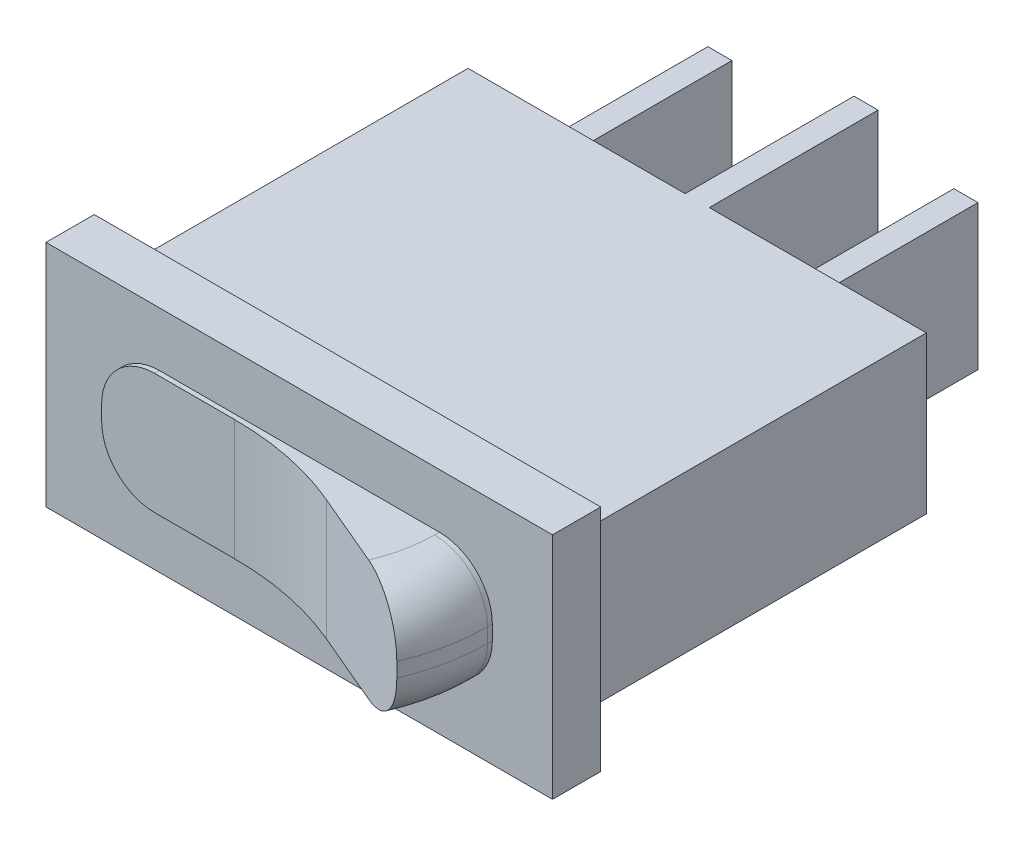
ISO-10303-21;
HEADER;
FILE_DESCRIPTION(('STEP AP214'),'2;1');
FILE_NAME('part.step','',(''),(''),'','','');
FILE_SCHEMA(('AUTOMOTIVE_DESIGN { 1 0 10303 214 1 1 1 1 }'));
ENDSEC;
DATA;
#1=APPLICATION_CONTEXT('core data for automotive mechanical design processes');
#2=APPLICATION_PROTOCOL_DEFINITION('international standard','automotive_design',2000,#1);
#3=PRODUCT_CONTEXT('',#1,'mechanical');
#4=PRODUCT('Part','Part','',(#3));
#5=PRODUCT_RELATED_PRODUCT_CATEGORY('part','',(#4));
#6=PRODUCT_DEFINITION_FORMATION('','',#4);
#7=PRODUCT_DEFINITION_CONTEXT('part definition',#1,'design');
#8=PRODUCT_DEFINITION('design','',#6,#7);
#9=PRODUCT_DEFINITION_SHAPE('','',#8);
#10=(LENGTH_UNIT() NAMED_UNIT(*) SI_UNIT(.MILLI.,.METRE.));
#11=(NAMED_UNIT(*) PLANE_ANGLE_UNIT() SI_UNIT($,.RADIAN.));
#12=(NAMED_UNIT(*) SI_UNIT($,.STERADIAN.) SOLID_ANGLE_UNIT());
#13=UNCERTAINTY_MEASURE_WITH_UNIT(LENGTH_MEASURE(1.E-05),#10,'distance_accuracy_value','');
#14=(GEOMETRIC_REPRESENTATION_CONTEXT(3) GLOBAL_UNCERTAINTY_ASSIGNED_CONTEXT((#13)) GLOBAL_UNIT_ASSIGNED_CONTEXT((#10,
#11,#12)) REPRESENTATION_CONTEXT('',''));
#15=CARTESIAN_POINT('',(0.,0.,0.));
#16=DIRECTION('',(0.,0.,1.));
#17=DIRECTION('',(1.,0.,0.));
#18=AXIS2_PLACEMENT_3D('',#15,#16,#17);
#19=CARTESIAN_POINT('',(0.,0.,-14.5));
#20=DIRECTION('',(0.,0.,-1.));
#21=DIRECTION('',(-1.,0.,0.));
#22=AXIS2_PLACEMENT_3D('',#19,#20,#21);
#23=PLANE('',#22);
#24=DIRECTION('',(0.,1.,0.));
#25=VECTOR('',#24,1.);
#26=CARTESIAN_POINT('',(10.,1.5,-14.5));
#27=LINE('',#26,#25);
#28=CARTESIAN_POINT('',(10.,1.5,-14.5));
#29=VERTEX_POINT('',#28);
#30=CARTESIAN_POINT('',(10.,8.,-14.5));
#31=VERTEX_POINT('',#30);
#32=EDGE_CURVE('E478',#29,#31,#27,.T.);
#33=ORIENTED_EDGE('',*,*,#32,.F.);
#34=DIRECTION('',(-1.,0.,0.));
#35=VECTOR('',#34,1.);
#36=CARTESIAN_POINT('',(10.,1.5,-14.5));
#37=LINE('',#36,#35);
#38=CARTESIAN_POINT('',(1.,1.5,-14.5));
#39=VERTEX_POINT('',#38);
#40=EDGE_CURVE('E480',#29,#39,#37,.T.);
#41=ORIENTED_EDGE('',*,*,#40,.T.);
#42=DIRECTION('',(0.,1.,0.));
#43=VECTOR('',#42,1.);
#44=CARTESIAN_POINT('',(1.,1.5,-14.5));
#45=LINE('',#44,#43);
#46=CARTESIAN_POINT('',(1.,8.,-14.5));
#47=VERTEX_POINT('',#46);
#48=EDGE_CURVE('E462',#39,#47,#45,.T.);
#49=ORIENTED_EDGE('',*,*,#48,.T.);
#50=DIRECTION('',(1.,0.,0.));
#51=VECTOR('',#50,1.);
#52=CARTESIAN_POINT('',(1.,8.,-14.5));
#53=LINE('',#52,#51);
#54=EDGE_CURVE('E444',#47,#31,#53,.T.);
#55=ORIENTED_EDGE('',*,*,#54,.T.);
#56=EDGE_LOOP('',(#33,#41,#49,#55));
#57=FACE_BOUND('',#56,.T.);
#58=DIRECTION('',(-1.,0.,0.));
#59=VECTOR('',#58,1.);
#60=CARTESIAN_POINT('',(4.941151629397,1.75,-14.5));
#61=LINE('',#60,#59);
#62=CARTESIAN_POINT('',(5.941151629397,1.75,-14.5));
#63=VERTEX_POINT('',#62);
#64=CARTESIAN_POINT('',(4.941151629397,1.75,-14.5));
#65=VERTEX_POINT('',#64);
#66=EDGE_CURVE('E1025',#63,#65,#61,.T.);
#67=ORIENTED_EDGE('',*,*,#66,.F.);
#68=DIRECTION('',(0.,-1.,0.));
#69=VECTOR('',#68,1.);
#70=CARTESIAN_POINT('',(5.941151629397,1.75,-14.5));
#71=LINE('',#70,#69);
#72=CARTESIAN_POINT('',(5.941151629397,7.75,-14.5));
#73=VERTEX_POINT('',#72);
#74=EDGE_CURVE('E269',#73,#63,#71,.T.);
#75=ORIENTED_EDGE('',*,*,#74,.F.);
#76=DIRECTION('',(1.,0.,0.));
#77=VECTOR('',#76,1.);
#78=CARTESIAN_POINT('',(4.941151629397,7.75,-14.5));
#79=LINE('',#78,#77);
#80=CARTESIAN_POINT('',(4.941151629397,7.75,-14.5));
#81=VERTEX_POINT('',#80);
#82=EDGE_CURVE('E265',#81,#73,#79,.T.);
#83=ORIENTED_EDGE('',*,*,#82,.F.);
#84=DIRECTION('',(0.,1.,0.));
#85=VECTOR('',#84,1.);
#86=CARTESIAN_POINT('',(4.941151629397,1.75,-14.5));
#87=LINE('',#86,#85);
#88=EDGE_CURVE('E1022',#65,#81,#87,.T.);
#89=ORIENTED_EDGE('',*,*,#88,.F.);
#90=EDGE_LOOP('',(#67,#75,#83,#89));
#91=FACE_BOUND('',#90,.T.);
#92=ADVANCED_FACE('F36',(#57,#91),#23,.T.);
#93=CARTESIAN_POINT('',(0.,0.,-14.5));
#94=DIRECTION('',(0.,0.,-1.));
#95=DIRECTION('',(-1.,0.,0.));
#96=AXIS2_PLACEMENT_3D('',#93,#94,#95);
#97=PLANE('',#96);
#98=DIRECTION('',(0.,-1.,0.));
#99=VECTOR('',#98,1.);
#100=CARTESIAN_POINT('',(11.,8.,-14.5));
#101=LINE('',#100,#99);
#102=CARTESIAN_POINT('',(11.,8.,-14.5));
#103=VERTEX_POINT('',#102);
#104=CARTESIAN_POINT('',(11.,1.5,-14.5));
#105=VERTEX_POINT('',#104);
#106=EDGE_CURVE('E485',#103,#105,#101,.T.);
#107=ORIENTED_EDGE('',*,*,#106,.F.);
#108=DIRECTION('',(1.,0.,0.));
#109=VECTOR('',#108,1.);
#110=CARTESIAN_POINT('',(11.,8.,-14.5));
#111=LINE('',#110,#109);
#112=CARTESIAN_POINT('',(20.,8.,-14.5));
#113=VERTEX_POINT('',#112);
#114=EDGE_CURVE('E475',#103,#113,#111,.T.);
#115=ORIENTED_EDGE('',*,*,#114,.T.);
#116=DIRECTION('',(0.,-1.,0.));
#117=VECTOR('',#116,1.);
#118=CARTESIAN_POINT('',(20.,8.,-14.5));
#119=LINE('',#118,#117);
#120=CARTESIAN_POINT('',(20.,1.5,-14.5));
#121=VERTEX_POINT('',#120);
#122=EDGE_CURVE('E471',#113,#121,#119,.T.);
#123=ORIENTED_EDGE('',*,*,#122,.T.);
#124=DIRECTION('',(-1.,0.,0.));
#125=VECTOR('',#124,1.);
#126=CARTESIAN_POINT('',(20.,1.5,-14.5));
#127=LINE('',#126,#125);
#128=EDGE_CURVE('E459',#121,#105,#127,.T.);
#129=ORIENTED_EDGE('',*,*,#128,.T.);
#130=EDGE_LOOP('',(#107,#115,#123,#129));
#131=FACE_BOUND('',#130,.T.);
#132=DIRECTION('',(-1.,0.,0.));
#133=VECTOR('',#132,1.);
#134=CARTESIAN_POINT('',(15.1420231591906,1.75,-14.5));
#135=LINE('',#134,#133);
#136=CARTESIAN_POINT('',(16.1420231591906,1.75,-14.5));
#137=VERTEX_POINT('',#136);
#138=CARTESIAN_POINT('',(15.1420231591906,1.75,-14.5));
#139=VERTEX_POINT('',#138);
#140=EDGE_CURVE('E274',#137,#139,#135,.T.);
#141=ORIENTED_EDGE('',*,*,#140,.F.);
#142=DIRECTION('',(0.,-1.,0.));
#143=VECTOR('',#142,1.);
#144=CARTESIAN_POINT('',(16.1420231591906,1.75,-14.5));
#145=LINE('',#144,#143);
#146=CARTESIAN_POINT('',(16.1420231591906,7.75,-14.5));
#147=VERTEX_POINT('',#146);
#148=EDGE_CURVE('E271',#147,#137,#145,.T.);
#149=ORIENTED_EDGE('',*,*,#148,.F.);
#150=DIRECTION('',(1.,0.,0.));
#151=VECTOR('',#150,1.);
#152=CARTESIAN_POINT('',(15.1420231591906,7.75,-14.5));
#153=LINE('',#152,#151);
#154=CARTESIAN_POINT('',(15.1420231591906,7.75,-14.5));
#155=VERTEX_POINT('',#154);
#156=EDGE_CURVE('E283',#155,#147,#153,.T.);
#157=ORIENTED_EDGE('',*,*,#156,.F.);
#158=DIRECTION('',(0.,1.,0.));
#159=VECTOR('',#158,1.);
#160=CARTESIAN_POINT('',(15.1420231591906,1.75,-14.5));
#161=LINE('',#160,#159);
#162=EDGE_CURVE('E291',#139,#155,#161,.T.);
#163=ORIENTED_EDGE('',*,*,#162,.F.);
#164=EDGE_LOOP('',(#141,#149,#157,#163));
#165=FACE_BOUND('',#164,.T.);
#166=ADVANCED_FACE('F522',(#131,#165),#97,.T.);
#167=CARTESIAN_POINT('',(20.,1.5,0.));
#168=DIRECTION('',(0.,-1.,0.));
#169=DIRECTION('',(-1.,0.,0.));
#170=AXIS2_PLACEMENT_3D('',#167,#168,#169);
#171=PLANE('',#170);
#172=DIRECTION('',(1.,0.,0.));
#173=VECTOR('',#172,1.);
#174=CARTESIAN_POINT('',(1.,1.5,0.));
#175=LINE('',#174,#173);
#176=CARTESIAN_POINT('',(1.,1.5,0.));
#177=VERTEX_POINT('',#176);
#178=CARTESIAN_POINT('',(20.,1.5,0.));
#179=VERTEX_POINT('',#178);
#180=EDGE_CURVE('E11',#177,#179,#175,.T.);
#181=ORIENTED_EDGE('',*,*,#180,.F.);
#182=DIRECTION('',(0.,0.,-1.));
#183=VECTOR('',#182,1.);
#184=CARTESIAN_POINT('',(1.,1.5,0.));
#185=LINE('',#184,#183);
#186=EDGE_CURVE('E487',#177,#39,#185,.T.);
#187=ORIENTED_EDGE('',*,*,#186,.T.);
#188=ORIENTED_EDGE('',*,*,#40,.F.);
#189=DIRECTION('',(0.,0.,-1.));
#190=VECTOR('',#189,1.);
#191=CARTESIAN_POINT('',(10.,1.5,-14.5));
#192=LINE('',#191,#190);
#193=CARTESIAN_POINT('',(10.,1.5,-21.5));
#194=VERTEX_POINT('',#193);
#195=EDGE_CURVE('E473',#29,#194,#192,.T.);
#196=ORIENTED_EDGE('',*,*,#195,.T.);
#197=DIRECTION('',(-1.,0.,0.));
#198=VECTOR('',#197,1.);
#199=CARTESIAN_POINT('',(11.,1.5,-21.5));
#200=LINE('',#199,#198);
#201=CARTESIAN_POINT('',(11.,1.5,-21.5));
#202=VERTEX_POINT('',#201);
#203=EDGE_CURVE('E466',#202,#194,#200,.T.);
#204=ORIENTED_EDGE('',*,*,#203,.F.);
#205=DIRECTION('',(0.,0.,-1.));
#206=VECTOR('',#205,1.);
#207=CARTESIAN_POINT('',(11.,1.5,-14.5));
#208=LINE('',#207,#206);
#209=EDGE_CURVE('E453',#105,#202,#208,.T.);
#210=ORIENTED_EDGE('',*,*,#209,.F.);
#211=ORIENTED_EDGE('',*,*,#128,.F.);
#212=DIRECTION('',(0.,0.,-1.));
#213=VECTOR('',#212,1.);
#214=CARTESIAN_POINT('',(20.,1.5,0.));
#215=LINE('',#214,#213);
#216=EDGE_CURVE('E432',#179,#121,#215,.T.);
#217=ORIENTED_EDGE('',*,*,#216,.F.);
#218=EDGE_LOOP('',(#181,#187,#188,#196,#204,#210,#211,#217));
#219=FACE_BOUND('',#218,.T.);
#220=ADVANCED_FACE('F38',(#219),#171,.T.);
#221=CARTESIAN_POINT('',(1.,8.,0.));
#222=DIRECTION('',(0.,1.,0.));
#223=DIRECTION('',(1.,0.,0.));
#224=AXIS2_PLACEMENT_3D('',#221,#222,#223);
#225=PLANE('',#224);
#226=DIRECTION('',(-1.,0.,0.));
#227=VECTOR('',#226,1.);
#228=CARTESIAN_POINT('',(20.,8.,0.));
#229=LINE('',#228,#227);
#230=CARTESIAN_POINT('',(20.,8.,0.));
#231=VERTEX_POINT('',#230);
#232=CARTESIAN_POINT('',(1.,8.,0.));
#233=VERTEX_POINT('',#232);
#234=EDGE_CURVE('E44',#231,#233,#229,.T.);
#235=ORIENTED_EDGE('',*,*,#234,.F.);
#236=DIRECTION('',(0.,0.,-1.));
#237=VECTOR('',#236,1.);
#238=CARTESIAN_POINT('',(20.,8.,0.));
#239=LINE('',#238,#237);
#240=EDGE_CURVE('E483',#231,#113,#239,.T.);
#241=ORIENTED_EDGE('',*,*,#240,.T.);
#242=ORIENTED_EDGE('',*,*,#114,.F.);
#243=DIRECTION('',(0.,0.,-1.));
#244=VECTOR('',#243,1.);
#245=CARTESIAN_POINT('',(11.,8.,-14.5));
#246=LINE('',#245,#244);
#247=CARTESIAN_POINT('',(11.,8.,-21.5));
#248=VERTEX_POINT('',#247);
#249=EDGE_CURVE('E469',#103,#248,#246,.T.);
#250=ORIENTED_EDGE('',*,*,#249,.T.);
#251=DIRECTION('',(1.,0.,0.));
#252=VECTOR('',#251,1.);
#253=CARTESIAN_POINT('',(10.,8.,-21.5));
#254=LINE('',#253,#252);
#255=CARTESIAN_POINT('',(10.,8.,-21.5));
#256=VERTEX_POINT('',#255);
#257=EDGE_CURVE('E456',#256,#248,#254,.T.);
#258=ORIENTED_EDGE('',*,*,#257,.F.);
#259=DIRECTION('',(0.,0.,-1.));
#260=VECTOR('',#259,1.);
#261=CARTESIAN_POINT('',(10.,8.,-14.5));
#262=LINE('',#261,#260);
#263=EDGE_CURVE('E464',#31,#256,#262,.T.);
#264=ORIENTED_EDGE('',*,*,#263,.F.);
#265=ORIENTED_EDGE('',*,*,#54,.F.);
#266=DIRECTION('',(0.,0.,-1.));
#267=VECTOR('',#266,1.);
#268=CARTESIAN_POINT('',(1.,8.,0.));
#269=LINE('',#268,#267);
#270=EDGE_CURVE('E429',#233,#47,#269,.T.);
#271=ORIENTED_EDGE('',*,*,#270,.F.);
#272=EDGE_LOOP('',(#235,#241,#242,#250,#258,#264,#265,#271));
#273=FACE_BOUND('',#272,.T.);
#274=ADVANCED_FACE('F496',(#273),#225,.T.);
#275=CARTESIAN_POINT('',(10.,1.5,-14.5));
#276=DIRECTION('',(-1.,0.,0.));
#277=DIRECTION('',(0.,1.,0.));
#278=AXIS2_PLACEMENT_3D('',#275,#276,#277);
#279=PLANE('',#278);
#280=ORIENTED_EDGE('',*,*,#32,.T.);
#281=ORIENTED_EDGE('',*,*,#263,.T.);
#282=DIRECTION('',(0.,1.,0.));
#283=VECTOR('',#282,1.);
#284=CARTESIAN_POINT('',(10.,1.5,-21.5));
#285=LINE('',#284,#283);
#286=EDGE_CURVE('E447',#194,#256,#285,.T.);
#287=ORIENTED_EDGE('',*,*,#286,.F.);
#288=ORIENTED_EDGE('',*,*,#195,.F.);
#289=EDGE_LOOP('',(#280,#281,#287,#288));
#290=FACE_BOUND('',#289,.T.);
#291=ADVANCED_FACE('F510',(#290),#279,.T.);
#292=CARTESIAN_POINT('',(11.,8.,-14.5));
#293=DIRECTION('',(1.,0.,0.));
#294=DIRECTION('',(0.,-1.,0.));
#295=AXIS2_PLACEMENT_3D('',#292,#293,#294);
#296=PLANE('',#295);
#297=ORIENTED_EDGE('',*,*,#106,.T.);
#298=ORIENTED_EDGE('',*,*,#209,.T.);
#299=DIRECTION('',(0.,-1.,0.));
#300=VECTOR('',#299,1.);
#301=CARTESIAN_POINT('',(11.,8.,-21.5));
#302=LINE('',#301,#300);
#303=EDGE_CURVE('E435',#248,#202,#302,.T.);
#304=ORIENTED_EDGE('',*,*,#303,.F.);
#305=ORIENTED_EDGE('',*,*,#249,.F.);
#306=EDGE_LOOP('',(#297,#298,#304,#305));
#307=FACE_BOUND('',#306,.T.);
#308=ADVANCED_FACE('F516',(#307),#296,.T.);
#309=CARTESIAN_POINT('',(0.,0.,0.));
#310=DIRECTION('',(0.,0.,1.));
#311=DIRECTION('',(1.,0.,0.));
#312=AXIS2_PLACEMENT_3D('',#309,#310,#311);
#313=PLANE('',#312);
#314=DIRECTION('',(1.,0.,0.));
#315=VECTOR('',#314,1.);
#316=CARTESIAN_POINT('',(0.,0.,0.));
#317=LINE('',#316,#315);
#318=CARTESIAN_POINT('',(0.,0.,0.));
#319=VERTEX_POINT('',#318);
#320=CARTESIAN_POINT('',(21.,0.,0.));
#321=VERTEX_POINT('',#320);
#322=EDGE_CURVE('E450',#319,#321,#317,.T.);
#323=ORIENTED_EDGE('',*,*,#322,.F.);
#324=DIRECTION('',(0.,-1.,0.));
#325=VECTOR('',#324,1.);
#326=CARTESIAN_POINT('',(0.,9.5,0.));
#327=LINE('',#326,#325);
#328=CARTESIAN_POINT('',(0.,9.5,0.));
#329=VERTEX_POINT('',#328);
#330=EDGE_CURVE('E438',#329,#319,#327,.T.);
#331=ORIENTED_EDGE('',*,*,#330,.F.);
#332=DIRECTION('',(-1.,0.,0.));
#333=VECTOR('',#332,1.);
#334=CARTESIAN_POINT('',(21.,9.5,0.));
#335=LINE('',#334,#333);
#336=CARTESIAN_POINT('',(21.,9.5,0.));
#337=VERTEX_POINT('',#336);
#338=EDGE_CURVE('E426',#337,#329,#335,.T.);
#339=ORIENTED_EDGE('',*,*,#338,.F.);
#340=DIRECTION('',(0.,1.,0.));
#341=VECTOR('',#340,1.);
#342=CARTESIAN_POINT('',(21.,0.,0.));
#343=LINE('',#342,#341);
#344=EDGE_CURVE('E420',#321,#337,#343,.T.);
#345=ORIENTED_EDGE('',*,*,#344,.F.);
#346=EDGE_LOOP('',(#323,#331,#339,#345));
#347=FACE_BOUND('',#346,.T.);
#348=DIRECTION('',(0.,-1.,0.));
#349=VECTOR('',#348,1.);
#350=CARTESIAN_POINT('',(1.,8.,0.));
#351=LINE('',#350,#349);
#352=EDGE_CURVE('E441',#233,#177,#351,.T.);
#353=ORIENTED_EDGE('',*,*,#352,.T.);
#354=ORIENTED_EDGE('',*,*,#180,.T.);
#355=DIRECTION('',(0.,1.,0.));
#356=VECTOR('',#355,1.);
#357=CARTESIAN_POINT('',(20.,1.5,0.));
#358=LINE('',#357,#356);
#359=EDGE_CURVE('E423',#179,#231,#358,.T.);
#360=ORIENTED_EDGE('',*,*,#359,.T.);
#361=ORIENTED_EDGE('',*,*,#234,.T.);
#362=EDGE_LOOP('',(#353,#354,#360,#361));
#363=FACE_BOUND('',#362,.T.);
#364=ADVANCED_FACE('F490',(#347,#363),#313,.F.);
#365=CARTESIAN_POINT('',(1.,1.5,0.));
#366=DIRECTION('',(-1.,0.,0.));
#367=DIRECTION('',(0.,1.,0.));
#368=AXIS2_PLACEMENT_3D('',#365,#366,#367);
#369=PLANE('',#368);
#370=ORIENTED_EDGE('',*,*,#352,.F.);
#371=ORIENTED_EDGE('',*,*,#270,.T.);
#372=ORIENTED_EDGE('',*,*,#48,.F.);
#373=ORIENTED_EDGE('',*,*,#186,.F.);
#374=EDGE_LOOP('',(#370,#371,#372,#373));
#375=FACE_BOUND('',#374,.T.);
#376=ADVANCED_FACE('F502',(#375),#369,.T.);
#377=CARTESIAN_POINT('',(0.,0.,-21.5));
#378=DIRECTION('',(0.,0.,-1.));
#379=DIRECTION('',(-1.,0.,0.));
#380=AXIS2_PLACEMENT_3D('',#377,#378,#379);
#381=PLANE('',#380);
#382=ORIENTED_EDGE('',*,*,#257,.T.);
#383=ORIENTED_EDGE('',*,*,#303,.T.);
#384=ORIENTED_EDGE('',*,*,#203,.T.);
#385=ORIENTED_EDGE('',*,*,#286,.T.);
#386=EDGE_LOOP('',(#382,#383,#384,#385));
#387=FACE_BOUND('',#386,.T.);
#388=ADVANCED_FACE('F518',(#387),#381,.T.);
#389=CARTESIAN_POINT('',(20.,8.,0.));
#390=DIRECTION('',(1.,0.,0.));
#391=DIRECTION('',(0.,-1.,0.));
#392=AXIS2_PLACEMENT_3D('',#389,#390,#391);
#393=PLANE('',#392);
#394=ORIENTED_EDGE('',*,*,#359,.F.);
#395=ORIENTED_EDGE('',*,*,#216,.T.);
#396=ORIENTED_EDGE('',*,*,#122,.F.);
#397=ORIENTED_EDGE('',*,*,#240,.F.);
#398=EDGE_LOOP('',(#394,#395,#396,#397));
#399=FACE_BOUND('',#398,.T.);
#400=ADVANCED_FACE('F525',(#399),#393,.T.);
#401=CARTESIAN_POINT('',(0.,0.,0.));
#402=DIRECTION('',(0.,-1.,0.));
#403=DIRECTION('',(1.,0.,0.));
#404=AXIS2_PLACEMENT_3D('',#401,#402,#403);
#405=PLANE('',#404);
#406=ORIENTED_EDGE('',*,*,#322,.T.);
#407=DIRECTION('',(0.,0.,1.));
#408=VECTOR('',#407,1.);
#409=CARTESIAN_POINT('',(21.,0.,0.));
#410=LINE('',#409,#408);
#411=CARTESIAN_POINT('',(21.,0.,2.));
#412=VERTEX_POINT('',#411);
#413=EDGE_CURVE('E418',#321,#412,#410,.T.);
#414=ORIENTED_EDGE('',*,*,#413,.T.);
#415=DIRECTION('',(1.,0.,0.));
#416=VECTOR('',#415,1.);
#417=CARTESIAN_POINT('',(0.,0.,2.));
#418=LINE('',#417,#416);
#419=CARTESIAN_POINT('',(0.,0.,2.));
#420=VERTEX_POINT('',#419);
#421=EDGE_CURVE('E413',#420,#412,#418,.T.);
#422=ORIENTED_EDGE('',*,*,#421,.F.);
#423=DIRECTION('',(0.,0.,1.));
#424=VECTOR('',#423,1.);
#425=CARTESIAN_POINT('',(0.,0.,0.));
#426=LINE('',#425,#424);
#427=EDGE_CURVE('E416',#319,#420,#426,.T.);
#428=ORIENTED_EDGE('',*,*,#427,.F.);
#429=EDGE_LOOP('',(#406,#414,#422,#428));
#430=FACE_BOUND('',#429,.T.);
#431=ADVANCED_FACE('F527',(#430),#405,.T.);
#432=CARTESIAN_POINT('',(0.,9.5,0.));
#433=DIRECTION('',(-1.,0.,0.));
#434=DIRECTION('',(0.,-1.,0.));
#435=AXIS2_PLACEMENT_3D('',#432,#433,#434);
#436=PLANE('',#435);
#437=ORIENTED_EDGE('',*,*,#330,.T.);
#438=ORIENTED_EDGE('',*,*,#427,.T.);
#439=DIRECTION('',(0.,-1.,0.));
#440=VECTOR('',#439,1.);
#441=CARTESIAN_POINT('',(0.,9.5,2.));
#442=LINE('',#441,#440);
#443=CARTESIAN_POINT('',(0.,9.5,2.));
#444=VERTEX_POINT('',#443);
#445=EDGE_CURVE('E408',#444,#420,#442,.T.);
#446=ORIENTED_EDGE('',*,*,#445,.F.);
#447=DIRECTION('',(0.,0.,1.));
#448=VECTOR('',#447,1.);
#449=CARTESIAN_POINT('',(0.,9.5,0.));
#450=LINE('',#449,#448);
#451=EDGE_CURVE('E411',#329,#444,#450,.T.);
#452=ORIENTED_EDGE('',*,*,#451,.F.);
#453=EDGE_LOOP('',(#437,#438,#446,#452));
#454=FACE_BOUND('',#453,.T.);
#455=ADVANCED_FACE('F533',(#454),#436,.T.);
#456=CARTESIAN_POINT('',(21.,9.5,0.));
#457=DIRECTION('',(0.,1.,0.));
#458=DIRECTION('',(-1.,0.,0.));
#459=AXIS2_PLACEMENT_3D('',#456,#457,#458);
#460=PLANE('',#459);
#461=ORIENTED_EDGE('',*,*,#338,.T.);
#462=ORIENTED_EDGE('',*,*,#451,.T.);
#463=DIRECTION('',(-1.,0.,0.));
#464=VECTOR('',#463,1.);
#465=CARTESIAN_POINT('',(21.,9.5,2.));
#466=LINE('',#465,#464);
#467=CARTESIAN_POINT('',(21.,9.5,2.));
#468=VERTEX_POINT('',#467);
#469=EDGE_CURVE('E400',#468,#444,#466,.T.);
#470=ORIENTED_EDGE('',*,*,#469,.F.);
#471=DIRECTION('',(0.,0.,1.));
#472=VECTOR('',#471,1.);
#473=CARTESIAN_POINT('',(21.,9.5,0.));
#474=LINE('',#473,#472);
#475=EDGE_CURVE('E403',#337,#468,#474,.T.);
#476=ORIENTED_EDGE('',*,*,#475,.F.);
#477=EDGE_LOOP('',(#461,#462,#470,#476));
#478=FACE_BOUND('',#477,.T.);
#479=ADVANCED_FACE('F727',(#478),#460,.T.);
#480=CARTESIAN_POINT('',(21.,0.,0.));
#481=DIRECTION('',(1.,0.,0.));
#482=DIRECTION('',(0.,1.,0.));
#483=AXIS2_PLACEMENT_3D('',#480,#481,#482);
#484=PLANE('',#483);
#485=ORIENTED_EDGE('',*,*,#344,.T.);
#486=ORIENTED_EDGE('',*,*,#475,.T.);
#487=DIRECTION('',(0.,1.,0.));
#488=VECTOR('',#487,1.);
#489=CARTESIAN_POINT('',(21.,0.,2.));
#490=LINE('',#489,#488);
#491=EDGE_CURVE('E406',#412,#468,#490,.T.);
#492=ORIENTED_EDGE('',*,*,#491,.F.);
#493=ORIENTED_EDGE('',*,*,#413,.F.);
#494=EDGE_LOOP('',(#485,#486,#492,#493));
#495=FACE_BOUND('',#494,.T.);
#496=ADVANCED_FACE('F723',(#495),#484,.T.);
#497=CARTESIAN_POINT('',(0.,0.,2.));
#498=DIRECTION('',(0.,0.,1.));
#499=DIRECTION('',(1.,0.,0.));
#500=AXIS2_PLACEMENT_3D('',#497,#498,#499);
#501=PLANE('',#500);
#502=ORIENTED_EDGE('',*,*,#491,.T.);
#503=ORIENTED_EDGE('',*,*,#469,.T.);
#504=ORIENTED_EDGE('',*,*,#445,.T.);
#505=ORIENTED_EDGE('',*,*,#421,.T.);
#506=EDGE_LOOP('',(#502,#503,#504,#505));
#507=FACE_BOUND('',#506,.T.);
#508=CARTESIAN_POINT('',(4.70640036781205,5.05,2.));
#509=DIRECTION('',(0.,0.,1.));
#510=DIRECTION('',(0.,1.,0.));
#511=AXIS2_PLACEMENT_3D('',#508,#509,#510);
#512=CIRCLE('',#511,2.2);
#513=CARTESIAN_POINT('',(4.70640036781206,7.25,2.));
#514=VERTEX_POINT('',#513);
#515=CARTESIAN_POINT('',(2.50640036781205,5.05,2.));
#516=VERTEX_POINT('',#515);
#517=EDGE_CURVE('E396',#514,#516,#512,.T.);
#518=ORIENTED_EDGE('',*,*,#517,.F.);
#519=DIRECTION('',(-1.,0.,0.));
#520=VECTOR('',#519,1.);
#521=CARTESIAN_POINT('',(16.3064003678121,7.25,2.));
#522=LINE('',#521,#520);
#523=CARTESIAN_POINT('',(16.3064003678121,7.25,2.));
#524=VERTEX_POINT('',#523);
#525=EDGE_CURVE('E393',#524,#514,#522,.T.);
#526=ORIENTED_EDGE('',*,*,#525,.F.);
#527=CARTESIAN_POINT('',(16.3064003678121,5.05,2.));
#528=DIRECTION('',(0.,0.,1.));
#529=DIRECTION('',(1.,0.,0.));
#530=AXIS2_PLACEMENT_3D('',#527,#528,#529);
#531=CIRCLE('',#530,2.2);
#532=CARTESIAN_POINT('',(18.5064003678121,5.05,2.));
#533=VERTEX_POINT('',#532);
#534=EDGE_CURVE('E383',#533,#524,#531,.T.);
#535=ORIENTED_EDGE('',*,*,#534,.F.);
#536=DIRECTION('',(0.,1.,0.));
#537=VECTOR('',#536,1.);
#538=CARTESIAN_POINT('',(18.5064003678121,4.45,2.));
#539=LINE('',#538,#537);
#540=CARTESIAN_POINT('',(18.5064003678121,4.45,2.));
#541=VERTEX_POINT('',#540);
#542=EDGE_CURVE('E375',#541,#533,#539,.T.);
#543=ORIENTED_EDGE('',*,*,#542,.F.);
#544=CARTESIAN_POINT('',(16.3064003678121,4.45,2.));
#545=DIRECTION('',(0.,0.,1.));
#546=DIRECTION('',(0.,-1.,0.));
#547=AXIS2_PLACEMENT_3D('',#544,#545,#546);
#548=CIRCLE('',#547,2.2);
#549=CARTESIAN_POINT('',(16.306400367812,2.25,2.));
#550=VERTEX_POINT('',#549);
#551=EDGE_CURVE('E363',#550,#541,#548,.T.);
#552=ORIENTED_EDGE('',*,*,#551,.F.);
#553=DIRECTION('',(1.,0.,0.));
#554=VECTOR('',#553,1.);
#555=CARTESIAN_POINT('',(4.70640036781205,2.25,2.));
#556=LINE('',#555,#554);
#557=CARTESIAN_POINT('',(4.70640036781205,2.25,2.));
#558=VERTEX_POINT('',#557);
#559=EDGE_CURVE('E351',#558,#550,#556,.T.);
#560=ORIENTED_EDGE('',*,*,#559,.F.);
#561=CARTESIAN_POINT('',(4.70640036781205,4.45,2.));
#562=DIRECTION('',(0.,0.,1.));
#563=DIRECTION('',(-1.,0.,0.));
#564=AXIS2_PLACEMENT_3D('',#561,#562,#563);
#565=CIRCLE('',#564,2.2);
#566=CARTESIAN_POINT('',(2.50640036781205,4.45,2.));
#567=VERTEX_POINT('',#566);
#568=EDGE_CURVE('E343',#567,#558,#565,.T.);
#569=ORIENTED_EDGE('',*,*,#568,.F.);
#570=DIRECTION('',(0.,-1.,0.));
#571=VECTOR('',#570,1.);
#572=CARTESIAN_POINT('',(2.50640036781205,5.05,2.));
#573=LINE('',#572,#571);
#574=EDGE_CURVE('E335',#516,#567,#573,.T.);
#575=ORIENTED_EDGE('',*,*,#574,.F.);
#576=EDGE_LOOP('',(#518,#526,#535,#543,#552,#560,#569,#575));
#577=FACE_BOUND('',#576,.T.);
#578=ADVANCED_FACE('F719',(#507,#577),#501,.T.);
#579=CARTESIAN_POINT('',(4.70640036781205,5.05,0.599999999999999));
#580=DIRECTION('',(0.,0.,-1.));
#581=DIRECTION('',(-1.,0.,0.));
#582=AXIS2_PLACEMENT_3D('',#579,#580,#581);
#583=CYLINDRICAL_SURFACE('',#582,2.2);
#584=DIRECTION('',(0.,0.,1.));
#585=VECTOR('',#584,1.);
#586=CARTESIAN_POINT('',(4.70640036781206,7.25,2.));
#587=LINE('',#586,#585);
#588=CARTESIAN_POINT('',(4.70640036781206,7.25,2.2));
#589=VERTEX_POINT('',#588);
#590=EDGE_CURVE('E398',#514,#589,#587,.T.);
#591=ORIENTED_EDGE('',*,*,#590,.F.);
#592=ORIENTED_EDGE('',*,*,#517,.T.);
#593=DIRECTION('',(0.,0.,1.));
#594=VECTOR('',#593,1.);
#595=CARTESIAN_POINT('',(2.50640036781205,5.05,2.));
#596=LINE('',#595,#594);
#597=CARTESIAN_POINT('',(2.50640036781205,5.05,2.2));
#598=VERTEX_POINT('',#597);
#599=EDGE_CURVE('E386',#516,#598,#596,.T.);
#600=ORIENTED_EDGE('',*,*,#599,.T.);
#601=CARTESIAN_POINT('',(4.70640036781205,5.05,2.2));
#602=DIRECTION('',(0.,0.,-1.));
#603=DIRECTION('',(-1.,0.,0.));
#604=AXIS2_PLACEMENT_3D('',#601,#602,#603);
#605=CIRCLE('',#604,2.2);
#606=EDGE_CURVE('E378',#598,#589,#605,.T.);
#607=ORIENTED_EDGE('',*,*,#606,.T.);
#608=EDGE_LOOP('',(#591,#592,#600,#607));
#609=FACE_BOUND('',#608,.T.);
#610=ADVANCED_FACE('F715',(#609),#583,.T.);
#611=CARTESIAN_POINT('',(18.5064003678121,7.25,2.));
#612=DIRECTION('',(0.,1.,0.));
#613=DIRECTION('',(-1.,0.,0.));
#614=AXIS2_PLACEMENT_3D('',#611,#612,#613);
#615=PLANE('',#614);
#616=ORIENTED_EDGE('',*,*,#590,.T.);
#617=DIRECTION('',(-1.,0.,0.));
#618=VECTOR('',#617,1.);
#619=CARTESIAN_POINT('',(8.02428231484292,7.25,2.2));
#620=LINE('',#619,#618);
#621=CARTESIAN_POINT('',(8.02428231484293,7.25,2.2));
#622=VERTEX_POINT('',#621);
#623=EDGE_CURVE('E388',#622,#589,#620,.T.);
#624=ORIENTED_EDGE('',*,*,#623,.F.);
#625=CARTESIAN_POINT('',(8.02428231484294,7.25,14.4));
#626=DIRECTION('',(0.,-1.,0.));
#627=DIRECTION('',(0.,0.,-1.));
#628=AXIS2_PLACEMENT_3D('',#625,#626,#627);
#629=CIRCLE('',#628,12.2);
#630=CARTESIAN_POINT('',(12.7912020824121,7.25,3.16984078788023));
#631=VERTEX_POINT('',#630);
#632=EDGE_CURVE('E381',#622,#631,#629,.T.);
#633=ORIENTED_EDGE('',*,*,#632,.T.);
#634=DIRECTION('',(0.92050485345244,0.,0.390731128489274));
#635=VECTOR('',#634,1.);
#636=CARTESIAN_POINT('',(12.7912020824121,7.25,3.16984078788023));
#637=LINE('',#636,#635);
#638=CARTESIAN_POINT('',(15.8453285178362,7.25,4.46624054523779));
#639=VERTEX_POINT('',#638);
#640=EDGE_CURVE('E366',#631,#639,#637,.T.);
#641=ORIENTED_EDGE('',*,*,#640,.T.);
#642=CARTESIAN_POINT('',(10.5064003678121,7.25,2.2));
#643=DIRECTION('',(0.,-1.,0.));
#644=DIRECTION('',(1.,0.,0.));
#645=AXIS2_PLACEMENT_3D('',#642,#643,#644);
#646=CIRCLE('',#645,5.8);
#647=CARTESIAN_POINT('',(16.3064003678121,7.25,2.2));
#648=VERTEX_POINT('',#647);
#649=EDGE_CURVE('E354',#648,#639,#646,.T.);
#650=ORIENTED_EDGE('',*,*,#649,.F.);
#651=DIRECTION('',(0.,0.,1.));
#652=VECTOR('',#651,1.);
#653=CARTESIAN_POINT('',(16.3064003678121,7.25,2.));
#654=LINE('',#653,#652);
#655=EDGE_CURVE('E368',#524,#648,#654,.T.);
#656=ORIENTED_EDGE('',*,*,#655,.F.);
#657=ORIENTED_EDGE('',*,*,#525,.T.);
#658=EDGE_LOOP('',(#616,#624,#633,#641,#650,#656,#657));
#659=FACE_BOUND('',#658,.T.);
#660=ADVANCED_FACE('F711',(#659),#615,.T.);
#661=CARTESIAN_POINT('',(16.3064003678121,5.05,0.599999999999999));
#662=DIRECTION('',(0.,0.,-1.));
#663=DIRECTION('',(0.,1.,0.));
#664=AXIS2_PLACEMENT_3D('',#661,#662,#663);
#665=CYLINDRICAL_SURFACE('',#664,2.2);
#666=DIRECTION('',(0.,0.,1.));
#667=VECTOR('',#666,1.);
#668=CARTESIAN_POINT('',(18.5064003678121,5.05,2.));
#669=LINE('',#668,#667);
#670=CARTESIAN_POINT('',(18.5064003678121,5.05,2.2));
#671=VERTEX_POINT('',#670);
#672=EDGE_CURVE('E391',#533,#671,#669,.T.);
#673=ORIENTED_EDGE('',*,*,#672,.F.);
#674=ORIENTED_EDGE('',*,*,#534,.T.);
#675=ORIENTED_EDGE('',*,*,#655,.T.);
#676=CARTESIAN_POINT('',(16.3064003678121,5.05,2.2));
#677=DIRECTION('',(0.,0.,1.));
#678=DIRECTION('',(1.,0.,0.));
#679=AXIS2_PLACEMENT_3D('',#676,#677,#678);
#680=CIRCLE('',#679,2.2);
#681=EDGE_CURVE('E357',#671,#648,#680,.T.);
#682=ORIENTED_EDGE('',*,*,#681,.F.);
#683=EDGE_LOOP('',(#673,#674,#675,#682));
#684=FACE_BOUND('',#683,.T.);
#685=ADVANCED_FACE('F707',(#684),#665,.T.);
#686=CARTESIAN_POINT('',(18.5064003678121,2.25,2.));
#687=DIRECTION('',(1.,0.,0.));
#688=DIRECTION('',(0.,1.,0.));
#689=AXIS2_PLACEMENT_3D('',#686,#687,#688);
#690=PLANE('',#689);
#691=ORIENTED_EDGE('',*,*,#672,.T.);
#692=DIRECTION('',(0.,1.,0.));
#693=VECTOR('',#692,1.);
#694=CARTESIAN_POINT('',(18.5064003678121,4.45,2.2));
#695=LINE('',#694,#693);
#696=CARTESIAN_POINT('',(18.5064003678121,4.45,2.2));
#697=VERTEX_POINT('',#696);
#698=EDGE_CURVE('E370',#697,#671,#695,.T.);
#699=ORIENTED_EDGE('',*,*,#698,.F.);
#700=DIRECTION('',(0.,0.,1.));
#701=VECTOR('',#700,1.);
#702=CARTESIAN_POINT('',(18.5064003678121,4.45,2.));
#703=LINE('',#702,#701);
#704=EDGE_CURVE('E360',#541,#697,#703,.T.);
#705=ORIENTED_EDGE('',*,*,#704,.F.);
#706=ORIENTED_EDGE('',*,*,#542,.T.);
#707=EDGE_LOOP('',(#691,#699,#705,#706));
#708=FACE_BOUND('',#707,.T.);
#709=ADVANCED_FACE('F697',(#708),#690,.T.);
#710=CARTESIAN_POINT('',(16.3064003678121,4.45,0.599999999999999));
#711=DIRECTION('',(0.,0.,-1.));
#712=DIRECTION('',(1.,0.,0.));
#713=AXIS2_PLACEMENT_3D('',#710,#711,#712);
#714=CYLINDRICAL_SURFACE('',#713,2.2);
#715=DIRECTION('',(0.,0.,1.));
#716=VECTOR('',#715,1.);
#717=CARTESIAN_POINT('',(16.306400367812,2.25,2.));
#718=LINE('',#717,#716);
#719=CARTESIAN_POINT('',(16.3064003678121,2.25,2.2));
#720=VERTEX_POINT('',#719);
#721=EDGE_CURVE('E373',#550,#720,#718,.T.);
#722=ORIENTED_EDGE('',*,*,#721,.F.);
#723=ORIENTED_EDGE('',*,*,#551,.T.);
#724=ORIENTED_EDGE('',*,*,#704,.T.);
#725=CARTESIAN_POINT('',(16.3064003678121,4.45,2.2));
#726=DIRECTION('',(0.,0.,1.));
#727=DIRECTION('',(0.,-1.,0.));
#728=AXIS2_PLACEMENT_3D('',#725,#726,#727);
#729=CIRCLE('',#728,2.2);
#730=EDGE_CURVE('E338',#720,#697,#729,.T.);
#731=ORIENTED_EDGE('',*,*,#730,.F.);
#732=EDGE_LOOP('',(#722,#723,#724,#731));
#733=FACE_BOUND('',#732,.T.);
#734=ADVANCED_FACE('F689',(#733),#714,.T.);
#735=CARTESIAN_POINT('',(2.50640036781205,2.25,2.));
#736=DIRECTION('',(0.,-1.,0.));
#737=DIRECTION('',(1.,0.,0.));
#738=AXIS2_PLACEMENT_3D('',#735,#736,#737);
#739=PLANE('',#738);
#740=ORIENTED_EDGE('',*,*,#721,.T.);
#741=CARTESIAN_POINT('',(10.5064003678121,2.25,2.2));
#742=DIRECTION('',(0.,-1.,0.));
#743=DIRECTION('',(1.,0.,0.));
#744=AXIS2_PLACEMENT_3D('',#741,#742,#743);
#745=CIRCLE('',#744,5.8);
#746=CARTESIAN_POINT('',(15.8453285178362,2.25,4.46624054523779));
#747=VERTEX_POINT('',#746);
#748=EDGE_CURVE('E346',#720,#747,#745,.T.);
#749=ORIENTED_EDGE('',*,*,#748,.T.);
#750=DIRECTION('',(-0.92050485345244,0.,-0.390731128489274));
#751=VECTOR('',#750,1.);
#752=CARTESIAN_POINT('',(15.8453285178362,2.25,4.46624054523779));
#753=LINE('',#752,#751);
#754=CARTESIAN_POINT('',(12.7912020824121,2.25,3.16984078788023));
#755=VERTEX_POINT('',#754);
#756=EDGE_CURVE('E341',#747,#755,#753,.T.);
#757=ORIENTED_EDGE('',*,*,#756,.T.);
#758=CARTESIAN_POINT('',(8.02428231484294,2.25,14.4));
#759=DIRECTION('',(0.,-1.,0.));
#760=DIRECTION('',(0.,0.,-1.));
#761=AXIS2_PLACEMENT_3D('',#758,#759,#760);
#762=CIRCLE('',#761,12.2);
#763=CARTESIAN_POINT('',(8.02428231484293,2.25,2.2));
#764=VERTEX_POINT('',#763);
#765=EDGE_CURVE('E330',#764,#755,#762,.T.);
#766=ORIENTED_EDGE('',*,*,#765,.F.);
#767=DIRECTION('',(1.,0.,0.));
#768=VECTOR('',#767,1.);
#769=CARTESIAN_POINT('',(4.70640036781205,2.25,2.2));
#770=LINE('',#769,#768);
#771=CARTESIAN_POINT('',(4.70640036781205,2.25,2.2));
#772=VERTEX_POINT('',#771);
#773=EDGE_CURVE('E319',#772,#764,#770,.T.);
#774=ORIENTED_EDGE('',*,*,#773,.F.);
#775=DIRECTION('',(0.,0.,1.));
#776=VECTOR('',#775,1.);
#777=CARTESIAN_POINT('',(4.70640036781205,2.25,2.));
#778=LINE('',#777,#776);
#779=EDGE_CURVE('E333',#558,#772,#778,.T.);
#780=ORIENTED_EDGE('',*,*,#779,.F.);
#781=ORIENTED_EDGE('',*,*,#559,.T.);
#782=EDGE_LOOP('',(#740,#749,#757,#766,#774,#780,#781));
#783=FACE_BOUND('',#782,.T.);
#784=ADVANCED_FACE('F678',(#783),#739,.T.);
#785=CARTESIAN_POINT('',(4.70640036781205,4.45,0.599999999999999));
#786=DIRECTION('',(0.,0.,-1.));
#787=DIRECTION('',(0.,-1.,0.));
#788=AXIS2_PLACEMENT_3D('',#785,#786,#787);
#789=CYLINDRICAL_SURFACE('',#788,2.2);
#790=DIRECTION('',(0.,0.,1.));
#791=VECTOR('',#790,1.);
#792=CARTESIAN_POINT('',(2.50640036781205,4.45,2.));
#793=LINE('',#792,#791);
#794=CARTESIAN_POINT('',(2.50640036781205,4.45,2.2));
#795=VERTEX_POINT('',#794);
#796=EDGE_CURVE('E348',#567,#795,#793,.T.);
#797=ORIENTED_EDGE('',*,*,#796,.F.);
#798=ORIENTED_EDGE('',*,*,#568,.T.);
#799=ORIENTED_EDGE('',*,*,#779,.T.);
#800=CARTESIAN_POINT('',(4.70640036781205,4.45,2.2));
#801=DIRECTION('',(0.,0.,-1.));
#802=DIRECTION('',(0.,-1.,0.));
#803=AXIS2_PLACEMENT_3D('',#800,#801,#802);
#804=CIRCLE('',#803,2.2);
#805=EDGE_CURVE('E322',#772,#795,#804,.T.);
#806=ORIENTED_EDGE('',*,*,#805,.T.);
#807=EDGE_LOOP('',(#797,#798,#799,#806));
#808=FACE_BOUND('',#807,.T.);
#809=ADVANCED_FACE('F674',(#808),#789,.T.);
#810=CARTESIAN_POINT('',(2.50640036781205,7.25,2.));
#811=DIRECTION('',(-1.,0.,0.));
#812=DIRECTION('',(0.,-1.,0.));
#813=AXIS2_PLACEMENT_3D('',#810,#811,#812);
#814=PLANE('',#813);
#815=ORIENTED_EDGE('',*,*,#599,.F.);
#816=ORIENTED_EDGE('',*,*,#574,.T.);
#817=ORIENTED_EDGE('',*,*,#796,.T.);
#818=DIRECTION('',(0.,-1.,0.));
#819=VECTOR('',#818,1.);
#820=CARTESIAN_POINT('',(2.50640036781205,5.05,2.2));
#821=LINE('',#820,#819);
#822=EDGE_CURVE('E325',#598,#795,#821,.T.);
#823=ORIENTED_EDGE('',*,*,#822,.F.);
#824=EDGE_LOOP('',(#815,#816,#817,#823));
#825=FACE_BOUND('',#824,.T.);
#826=ADVANCED_FACE('F677',(#825),#814,.T.);
#827=CARTESIAN_POINT('',(0.,0.,2.2));
#828=DIRECTION('',(0.,0.,1.));
#829=DIRECTION('',(1.,0.,0.));
#830=AXIS2_PLACEMENT_3D('',#827,#828,#829);
#831=PLANE('',#830);
#832=ORIENTED_EDGE('',*,*,#606,.F.);
#833=ORIENTED_EDGE('',*,*,#822,.T.);
#834=ORIENTED_EDGE('',*,*,#805,.F.);
#835=ORIENTED_EDGE('',*,*,#773,.T.);
#836=DIRECTION('',(0.,-1.,0.));
#837=VECTOR('',#836,1.);
#838=CARTESIAN_POINT('',(8.02428231484292,7.24999999999999,2.2));
#839=LINE('',#838,#837);
#840=EDGE_CURVE('E327',#622,#764,#839,.T.);
#841=ORIENTED_EDGE('',*,*,#840,.F.);
#842=ORIENTED_EDGE('',*,*,#623,.T.);
#843=EDGE_LOOP('',(#832,#833,#834,#835,#841,#842));
#844=FACE_BOUND('',#843,.T.);
#845=ADVANCED_FACE('F693',(#844),#831,.T.);
#846=CARTESIAN_POINT('',(8.02428231484294,42.25,14.4));
#847=DIRECTION('',(0.,1.,0.));
#848=DIRECTION('',(0.390731128489274,0.,-0.92050485345244));
#849=AXIS2_PLACEMENT_3D('',#846,#847,#848);
#850=CYLINDRICAL_SURFACE('',#849,12.2);
#851=ORIENTED_EDGE('',*,*,#840,.T.);
#852=ORIENTED_EDGE('',*,*,#765,.T.);
#853=DIRECTION('',(0.,-1.,0.));
#854=VECTOR('',#853,1.);
#855=CARTESIAN_POINT('',(12.7912020824121,7.24999999999999,3.16984078788023));
#856=LINE('',#855,#854);
#857=EDGE_CURVE('E311',#631,#755,#856,.T.);
#858=ORIENTED_EDGE('',*,*,#857,.F.);
#859=ORIENTED_EDGE('',*,*,#632,.F.);
#860=EDGE_LOOP('',(#851,#852,#858,#859));
#861=FACE_BOUND('',#860,.T.);
#862=ADVANCED_FACE('F682',(#861),#850,.F.);
#863=CARTESIAN_POINT('',(0.835207836926553,0.,-1.90517767207532));
#864=DIRECTION('',(-0.390731128489274,0.,0.92050485345244));
#865=DIRECTION('',(0.92050485345244,0.,0.390731128489274));
#866=AXIS2_PLACEMENT_3D('',#863,#864,#865);
#867=PLANE('',#866);
#868=CARTESIAN_POINT('',(15.8453285178362,5.05,4.46624054523779));
#869=DIRECTION('',(-0.390731128489274,0.,0.92050485345244));
#870=DIRECTION('',(0.92050485345244,0.,0.390731128489274));
#871=AXIS2_PLACEMENT_3D('',#868,#869,#870);
#872=CIRCLE('',#871,2.2);
#873=CARTESIAN_POINT('',(17.8704391954316,5.05,5.32584902791419));
#874=VERTEX_POINT('',#873);
#875=EDGE_CURVE('E316',#874,#639,#872,.T.);
#876=ORIENTED_EDGE('',*,*,#875,.T.);
#877=ORIENTED_EDGE('',*,*,#640,.F.);
#878=ORIENTED_EDGE('',*,*,#857,.T.);
#879=ORIENTED_EDGE('',*,*,#756,.F.);
#880=CARTESIAN_POINT('',(15.8453285178362,4.45,4.46624054523779));
#881=DIRECTION('',(0.390731128489274,0.,-0.92050485345244));
#882=DIRECTION('',(0.92050485345244,0.,0.390731128489274));
#883=AXIS2_PLACEMENT_3D('',#880,#881,#882);
#884=CIRCLE('',#883,2.2);
#885=CARTESIAN_POINT('',(17.8704391954316,4.45,5.32584902791419));
#886=VERTEX_POINT('',#885);
#887=EDGE_CURVE('E302',#886,#747,#884,.T.);
#888=ORIENTED_EDGE('',*,*,#887,.F.);
#889=DIRECTION('',(0.,1.,0.));
#890=VECTOR('',#889,1.);
#891=CARTESIAN_POINT('',(17.8704391954316,4.45,5.32584902791419));
#892=LINE('',#891,#890);
#893=EDGE_CURVE('E308',#886,#874,#892,.T.);
#894=ORIENTED_EDGE('',*,*,#893,.T.);
#895=EDGE_LOOP('',(#876,#877,#878,#879,#888,#894));
#896=FACE_BOUND('',#895,.T.);
#897=ADVANCED_FACE('F672',(#896),#867,.T.);
#898=CARTESIAN_POINT('',(10.5064003678121,5.05,2.2));
#899=DIRECTION('',(0.,-1.,0.));
#900=DIRECTION('',(0.,0.,-1.));
#901=AXIS2_PLACEMENT_3D('',#898,#899,#900);
#902=TOROIDAL_SURFACE('',#901,5.8,2.2);
#903=CARTESIAN_POINT('',(10.5064003678121,5.05,2.2));
#904=DIRECTION('',(0.,-1.,0.));
#905=DIRECTION('',(1.,0.,0.));
#906=AXIS2_PLACEMENT_3D('',#903,#904,#905);
#907=CIRCLE('',#906,8.);
#908=EDGE_CURVE('E314',#671,#874,#907,.T.);
#909=ORIENTED_EDGE('',*,*,#908,.F.);
#910=ORIENTED_EDGE('',*,*,#681,.T.);
#911=ORIENTED_EDGE('',*,*,#649,.T.);
#912=ORIENTED_EDGE('',*,*,#875,.F.);
#913=EDGE_LOOP('',(#909,#910,#911,#912));
#914=FACE_BOUND('',#913,.T.);
#915=ADVANCED_FACE('F669',(#914),#902,.T.);
#916=CARTESIAN_POINT('',(10.5064003678121,7.25,2.2));
#917=DIRECTION('',(0.,-1.,0.));
#918=DIRECTION('',(1.,0.,0.));
#919=AXIS2_PLACEMENT_3D('',#916,#917,#918);
#920=CYLINDRICAL_SURFACE('',#919,8.);
#921=ORIENTED_EDGE('',*,*,#908,.T.);
#922=ORIENTED_EDGE('',*,*,#893,.F.);
#923=CARTESIAN_POINT('',(10.5064003678121,4.45,2.2));
#924=DIRECTION('',(0.,-1.,0.));
#925=DIRECTION('',(1.,0.,0.));
#926=AXIS2_PLACEMENT_3D('',#923,#924,#925);
#927=CIRCLE('',#926,8.);
#928=EDGE_CURVE('E305',#697,#886,#927,.T.);
#929=ORIENTED_EDGE('',*,*,#928,.F.);
#930=ORIENTED_EDGE('',*,*,#698,.T.);
#931=EDGE_LOOP('',(#921,#922,#929,#930));
#932=FACE_BOUND('',#931,.T.);
#933=ADVANCED_FACE('F667',(#932),#920,.T.);
#934=CARTESIAN_POINT('',(10.5064003678121,4.45,2.2));
#935=DIRECTION('',(0.,-1.,0.));
#936=DIRECTION('',(0.,0.,-1.));
#937=AXIS2_PLACEMENT_3D('',#934,#935,#936);
#938=TOROIDAL_SURFACE('',#937,5.8,2.2);
#939=ORIENTED_EDGE('',*,*,#748,.F.);
#940=ORIENTED_EDGE('',*,*,#730,.T.);
#941=ORIENTED_EDGE('',*,*,#928,.T.);
#942=ORIENTED_EDGE('',*,*,#887,.T.);
#943=EDGE_LOOP('',(#939,#940,#941,#942));
#944=FACE_BOUND('',#943,.T.);
#945=ADVANCED_FACE('F577',(#944),#938,.T.);
#946=CARTESIAN_POINT('',(16.1420231591906,1.75,-20.5));
#947=DIRECTION('',(-1.,0.,0.));
#948=DIRECTION('',(0.,0.,1.));
#949=AXIS2_PLACEMENT_3D('',#946,#947,#948);
#950=PLANE('',#949);
#951=ORIENTED_EDGE('',*,*,#148,.T.);
#952=DIRECTION('',(0.,0.,1.));
#953=VECTOR('',#952,1.);
#954=CARTESIAN_POINT('',(16.1420231591906,1.75,-20.5));
#955=LINE('',#954,#953);
#956=CARTESIAN_POINT('',(16.1420231591906,1.75,-20.5));
#957=VERTEX_POINT('',#956);
#958=EDGE_CURVE('E300',#957,#137,#955,.T.);
#959=ORIENTED_EDGE('',*,*,#958,.F.);
#960=DIRECTION('',(0.,-1.,0.));
#961=VECTOR('',#960,1.);
#962=CARTESIAN_POINT('',(16.1420231591906,1.75,-20.5));
#963=LINE('',#962,#961);
#964=CARTESIAN_POINT('',(16.1420231591906,7.75,-20.5));
#965=VERTEX_POINT('',#964);
#966=EDGE_CURVE('E279',#965,#957,#963,.T.);
#967=ORIENTED_EDGE('',*,*,#966,.F.);
#968=DIRECTION('',(0.,0.,1.));
#969=VECTOR('',#968,1.);
#970=CARTESIAN_POINT('',(16.1420231591906,7.75,-20.5));
#971=LINE('',#970,#969);
#972=EDGE_CURVE('E288',#965,#147,#971,.T.);
#973=ORIENTED_EDGE('',*,*,#972,.T.);
#974=EDGE_LOOP('',(#951,#959,#967,#973));
#975=FACE_BOUND('',#974,.T.);
#976=ADVANCED_FACE('F571',(#975),#950,.F.);
#977=CARTESIAN_POINT('',(15.1420231591906,1.75,-20.5));
#978=DIRECTION('',(0.,1.,0.));
#979=DIRECTION('',(-1.,0.,0.));
#980=AXIS2_PLACEMENT_3D('',#977,#978,#979);
#981=PLANE('',#980);
#982=ORIENTED_EDGE('',*,*,#140,.T.);
#983=DIRECTION('',(0.,0.,1.));
#984=VECTOR('',#983,1.);
#985=CARTESIAN_POINT('',(15.1420231591906,1.75,-20.5));
#986=LINE('',#985,#984);
#987=CARTESIAN_POINT('',(15.1420231591906,1.75,-20.5));
#988=VERTEX_POINT('',#987);
#989=EDGE_CURVE('E297',#988,#139,#986,.T.);
#990=ORIENTED_EDGE('',*,*,#989,.F.);
#991=DIRECTION('',(-1.,0.,0.));
#992=VECTOR('',#991,1.);
#993=CARTESIAN_POINT('',(15.1420231591906,1.75,-20.5));
#994=LINE('',#993,#992);
#995=EDGE_CURVE('E282',#957,#988,#994,.T.);
#996=ORIENTED_EDGE('',*,*,#995,.F.);
#997=ORIENTED_EDGE('',*,*,#958,.T.);
#998=EDGE_LOOP('',(#982,#990,#996,#997));
#999=FACE_BOUND('',#998,.T.);
#1000=ADVANCED_FACE('F576',(#999),#981,.F.);
#1001=CARTESIAN_POINT('',(15.1420231591906,1.75,-20.5));
#1002=DIRECTION('',(1.,0.,0.));
#1003=DIRECTION('',(0.,0.,-1.));
#1004=AXIS2_PLACEMENT_3D('',#1001,#1002,#1003);
#1005=PLANE('',#1004);
#1006=ORIENTED_EDGE('',*,*,#162,.T.);
#1007=DIRECTION('',(0.,0.,1.));
#1008=VECTOR('',#1007,1.);
#1009=CARTESIAN_POINT('',(15.1420231591906,7.75,-20.5));
#1010=LINE('',#1009,#1008);
#1011=CARTESIAN_POINT('',(15.1420231591906,7.75,-20.5));
#1012=VERTEX_POINT('',#1011);
#1013=EDGE_CURVE('E59',#1012,#155,#1010,.T.);
#1014=ORIENTED_EDGE('',*,*,#1013,.F.);
#1015=DIRECTION('',(0.,1.,0.));
#1016=VECTOR('',#1015,1.);
#1017=CARTESIAN_POINT('',(15.1420231591906,1.75,-20.5));
#1018=LINE('',#1017,#1016);
#1019=EDGE_CURVE('E285',#988,#1012,#1018,.T.);
#1020=ORIENTED_EDGE('',*,*,#1019,.F.);
#1021=ORIENTED_EDGE('',*,*,#989,.T.);
#1022=EDGE_LOOP('',(#1006,#1014,#1020,#1021));
#1023=FACE_BOUND('',#1022,.T.);
#1024=ADVANCED_FACE('F589',(#1023),#1005,.F.);
#1025=CARTESIAN_POINT('',(15.1420231591906,7.75,-20.5));
#1026=DIRECTION('',(0.,-1.,0.));
#1027=DIRECTION('',(0.,0.,-1.));
#1028=AXIS2_PLACEMENT_3D('',#1025,#1026,#1027);
#1029=PLANE('',#1028);
#1030=ORIENTED_EDGE('',*,*,#156,.T.);
#1031=ORIENTED_EDGE('',*,*,#972,.F.);
#1032=DIRECTION('',(1.,0.,0.));
#1033=VECTOR('',#1032,1.);
#1034=CARTESIAN_POINT('',(15.1420231591906,7.75,-20.5));
#1035=LINE('',#1034,#1033);
#1036=EDGE_CURVE('E287',#1012,#965,#1035,.T.);
#1037=ORIENTED_EDGE('',*,*,#1036,.F.);
#1038=ORIENTED_EDGE('',*,*,#1013,.T.);
#1039=EDGE_LOOP('',(#1030,#1031,#1037,#1038));
#1040=FACE_BOUND('',#1039,.T.);
#1041=ADVANCED_FACE('F599',(#1040),#1029,.F.);
#1042=CARTESIAN_POINT('',(0.,0.,-20.5));
#1043=DIRECTION('',(0.,0.,-1.));
#1044=DIRECTION('',(-1.,0.,0.));
#1045=AXIS2_PLACEMENT_3D('',#1042,#1043,#1044);
#1046=PLANE('',#1045);
#1047=ORIENTED_EDGE('',*,*,#966,.T.);
#1048=ORIENTED_EDGE('',*,*,#995,.T.);
#1049=ORIENTED_EDGE('',*,*,#1019,.T.);
#1050=ORIENTED_EDGE('',*,*,#1036,.T.);
#1051=EDGE_LOOP('',(#1047,#1048,#1049,#1050));
#1052=FACE_BOUND('',#1051,.T.);
#1053=ADVANCED_FACE('F609',(#1052),#1046,.T.);
#1054=CARTESIAN_POINT('',(5.941151629397,1.75,-20.5));
#1055=DIRECTION('',(-1.,0.,0.));
#1056=DIRECTION('',(0.,0.,1.));
#1057=AXIS2_PLACEMENT_3D('',#1054,#1055,#1056);
#1058=PLANE('',#1057);
#1059=ORIENTED_EDGE('',*,*,#74,.T.);
#1060=DIRECTION('',(0.,0.,1.));
#1061=VECTOR('',#1060,1.);
#1062=CARTESIAN_POINT('',(5.941151629397,1.75,-20.5));
#1063=LINE('',#1062,#1061);
#1064=CARTESIAN_POINT('',(5.941151629397,1.75,-20.5));
#1065=VERTEX_POINT('',#1064);
#1066=EDGE_CURVE('E250',#1065,#63,#1063,.T.);
#1067=ORIENTED_EDGE('',*,*,#1066,.F.);
#1068=DIRECTION('',(0.,-1.,0.));
#1069=VECTOR('',#1068,1.);
#1070=CARTESIAN_POINT('',(5.941151629397,1.75,-20.5));
#1071=LINE('',#1070,#1069);
#1072=CARTESIAN_POINT('',(5.941151629397,7.75,-20.5));
#1073=VERTEX_POINT('',#1072);
#1074=EDGE_CURVE('E257',#1073,#1065,#1071,.T.);
#1075=ORIENTED_EDGE('',*,*,#1074,.F.);
#1076=DIRECTION('',(0.,0.,1.));
#1077=VECTOR('',#1076,1.);
#1078=CARTESIAN_POINT('',(5.941151629397,7.75,-20.5));
#1079=LINE('',#1078,#1077);
#1080=EDGE_CURVE('E1020',#1073,#73,#1079,.T.);
#1081=ORIENTED_EDGE('',*,*,#1080,.T.);
#1082=EDGE_LOOP('',(#1059,#1067,#1075,#1081));
#1083=FACE_BOUND('',#1082,.T.);
#1084=ADVANCED_FACE('F267',(#1083),#1058,.F.);
#1085=CARTESIAN_POINT('',(4.941151629397,1.75,-20.5));
#1086=DIRECTION('',(0.,1.,0.));
#1087=DIRECTION('',(-1.,0.,0.));
#1088=AXIS2_PLACEMENT_3D('',#1085,#1086,#1087);
#1089=PLANE('',#1088);
#1090=ORIENTED_EDGE('',*,*,#66,.T.);
#1091=DIRECTION('',(0.,0.,1.));
#1092=VECTOR('',#1091,1.);
#1093=CARTESIAN_POINT('',(4.941151629397,1.75,-20.5));
#1094=LINE('',#1093,#1092);
#1095=CARTESIAN_POINT('',(4.941151629397,1.75,-20.5));
#1096=VERTEX_POINT('',#1095);
#1097=EDGE_CURVE('E253',#1096,#65,#1094,.T.);
#1098=ORIENTED_EDGE('',*,*,#1097,.F.);
#1099=DIRECTION('',(-1.,0.,0.));
#1100=VECTOR('',#1099,1.);
#1101=CARTESIAN_POINT('',(4.941151629397,1.75,-20.5));
#1102=LINE('',#1101,#1100);
#1103=EDGE_CURVE('E246',#1065,#1096,#1102,.T.);
#1104=ORIENTED_EDGE('',*,*,#1103,.F.);
#1105=ORIENTED_EDGE('',*,*,#1066,.T.);
#1106=EDGE_LOOP('',(#1090,#1098,#1104,#1105));
#1107=FACE_BOUND('',#1106,.T.);
#1108=ADVANCED_FACE('F248',(#1107),#1089,.F.);
#1109=CARTESIAN_POINT('',(4.941151629397,1.75,-20.5));
#1110=DIRECTION('',(1.,0.,0.));
#1111=DIRECTION('',(0.,0.,-1.));
#1112=AXIS2_PLACEMENT_3D('',#1109,#1110,#1111);
#1113=PLANE('',#1112);
#1114=ORIENTED_EDGE('',*,*,#88,.T.);
#1115=DIRECTION('',(0.,0.,1.));
#1116=VECTOR('',#1115,1.);
#1117=CARTESIAN_POINT('',(4.941151629397,7.75,-20.5));
#1118=LINE('',#1117,#1116);
#1119=CARTESIAN_POINT('',(4.941151629397,7.75,-20.5));
#1120=VERTEX_POINT('',#1119);
#1121=EDGE_CURVE('E51',#1120,#81,#1118,.T.);
#1122=ORIENTED_EDGE('',*,*,#1121,.F.);
#1123=DIRECTION('',(0.,1.,0.));
#1124=VECTOR('',#1123,1.);
#1125=CARTESIAN_POINT('',(4.941151629397,1.75,-20.5));
#1126=LINE('',#1125,#1124);
#1127=EDGE_CURVE('E256',#1096,#1120,#1126,.T.);
#1128=ORIENTED_EDGE('',*,*,#1127,.F.);
#1129=ORIENTED_EDGE('',*,*,#1097,.T.);
#1130=EDGE_LOOP('',(#1114,#1122,#1128,#1129));
#1131=FACE_BOUND('',#1130,.T.);
#1132=ADVANCED_FACE('F635',(#1131),#1113,.F.);
#1133=CARTESIAN_POINT('',(4.941151629397,7.75,-20.5));
#1134=DIRECTION('',(0.,-1.,0.));
#1135=DIRECTION('',(0.,0.,-1.));
#1136=AXIS2_PLACEMENT_3D('',#1133,#1134,#1135);
#1137=PLANE('',#1136);
#1138=ORIENTED_EDGE('',*,*,#82,.T.);
#1139=ORIENTED_EDGE('',*,*,#1080,.F.);
#1140=DIRECTION('',(1.,0.,0.));
#1141=VECTOR('',#1140,1.);
#1142=CARTESIAN_POINT('',(4.941151629397,7.75,-20.5));
#1143=LINE('',#1142,#1141);
#1144=EDGE_CURVE('E261',#1120,#1073,#1143,.T.);
#1145=ORIENTED_EDGE('',*,*,#1144,.F.);
#1146=ORIENTED_EDGE('',*,*,#1121,.T.);
#1147=EDGE_LOOP('',(#1138,#1139,#1145,#1146));
#1148=FACE_BOUND('',#1147,.T.);
#1149=ADVANCED_FACE('F644',(#1148),#1137,.F.);
#1150=CARTESIAN_POINT('',(0.,0.,-20.5));
#1151=DIRECTION('',(0.,0.,-1.));
#1152=DIRECTION('',(-1.,0.,0.));
#1153=AXIS2_PLACEMENT_3D('',#1150,#1151,#1152);
#1154=PLANE('',#1153);
#1155=ORIENTED_EDGE('',*,*,#1074,.T.);
#1156=ORIENTED_EDGE('',*,*,#1103,.T.);
#1157=ORIENTED_EDGE('',*,*,#1127,.T.);
#1158=ORIENTED_EDGE('',*,*,#1144,.T.);
#1159=EDGE_LOOP('',(#1155,#1156,#1157,#1158));
#1160=FACE_BOUND('',#1159,.T.);
#1161=ADVANCED_FACE('F260',(#1160),#1154,.T.);
#1162=CLOSED_SHELL('',(#92,#166,#220,#274,#291,#308,#364,#376,#388,#400,#431,#455,#479,#496,
#578,#610,#660,#685,#709,#734,#784,#809,#826,#845,#862,#897,#915,#933,#945,#976,#1000,#1024,
#1041,#1053,#1084,#1108,#1132,#1149,#1161));
#1163=MANIFOLD_SOLID_BREP('B2',#1162);
#1164=ADVANCED_BREP_SHAPE_REPRESENTATION('',(#18,#1163),#14);
#1165=SHAPE_DEFINITION_REPRESENTATION(#9,#1164);
ENDSEC;
END-ISO-10303-21;
